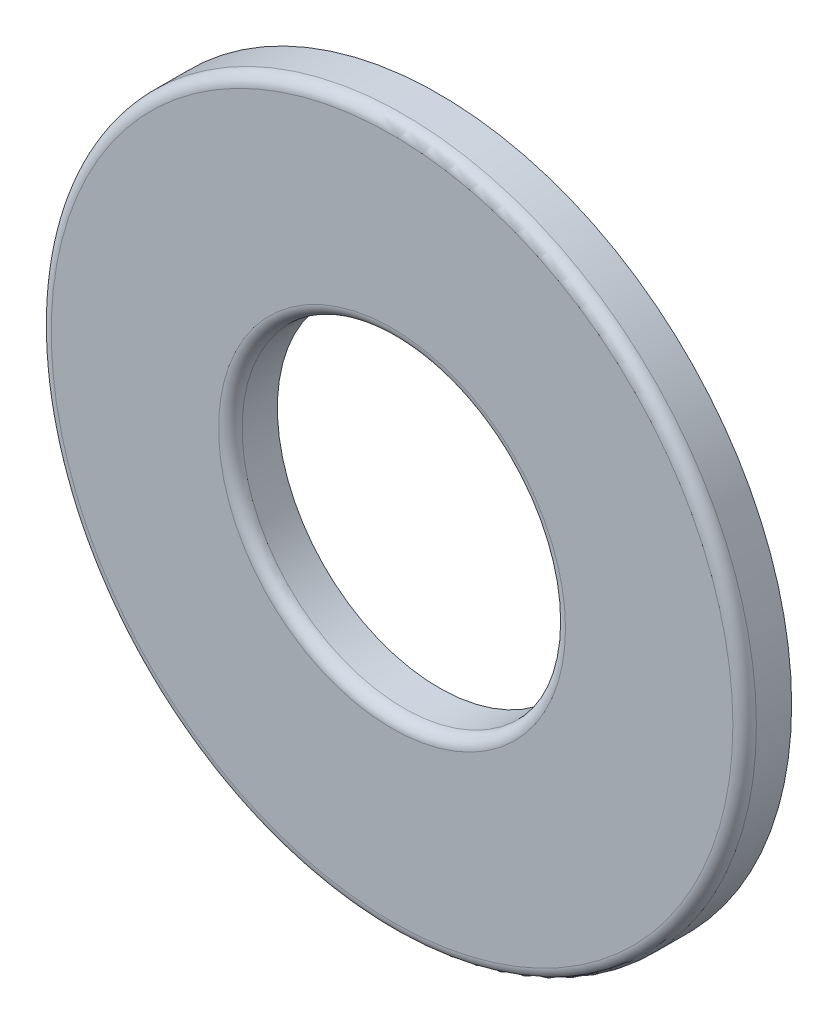
ISO-10303-21;
HEADER;
FILE_DESCRIPTION(('STEP AP214'),'2;1');
FILE_NAME('part.step','',(''),(''),'','','');
FILE_SCHEMA(('AUTOMOTIVE_DESIGN { 1 0 10303 214 1 1 1 1 }'));
ENDSEC;
DATA;
#1=APPLICATION_CONTEXT('core data for automotive mechanical design processes');
#2=APPLICATION_PROTOCOL_DEFINITION('international standard','automotive_design',2000,#1);
#3=PRODUCT_CONTEXT('',#1,'mechanical');
#4=PRODUCT('Part','Part','',(#3));
#5=PRODUCT_RELATED_PRODUCT_CATEGORY('part','',(#4));
#6=PRODUCT_DEFINITION_FORMATION('','',#4);
#7=PRODUCT_DEFINITION_CONTEXT('part definition',#1,'design');
#8=PRODUCT_DEFINITION('design','',#6,#7);
#9=PRODUCT_DEFINITION_SHAPE('','',#8);
#10=(LENGTH_UNIT() NAMED_UNIT(*) SI_UNIT(.MILLI.,.METRE.));
#11=(NAMED_UNIT(*) PLANE_ANGLE_UNIT() SI_UNIT($,.RADIAN.));
#12=(NAMED_UNIT(*) SI_UNIT($,.STERADIAN.) SOLID_ANGLE_UNIT());
#13=UNCERTAINTY_MEASURE_WITH_UNIT(LENGTH_MEASURE(1.E-05),#10,'distance_accuracy_value','');
#14=(GEOMETRIC_REPRESENTATION_CONTEXT(3) GLOBAL_UNCERTAINTY_ASSIGNED_CONTEXT((#13)) GLOBAL_UNIT_ASSIGNED_CONTEXT((#10,
#11,#12)) REPRESENTATION_CONTEXT('',''));
#15=CARTESIAN_POINT('',(0.,0.,0.));
#16=DIRECTION('',(0.,0.,1.));
#17=DIRECTION('',(1.,0.,0.));
#18=AXIS2_PLACEMENT_3D('',#15,#16,#17);
#19=CARTESIAN_POINT('',(0.,0.,0.634999999999997));
#20=DIRECTION('',(0.,0.,1.));
#21=DIRECTION('',(1.,0.,0.));
#22=AXIS2_PLACEMENT_3D('',#19,#20,#21);
#23=PLANE('',#22);
#24=CARTESIAN_POINT('',(0.,0.,0.634999999999997));
#25=DIRECTION('',(0.,0.,1.));
#26=DIRECTION('',(1.,0.,0.));
#27=AXIS2_PLACEMENT_3D('',#24,#25,#26);
#28=CIRCLE('',#27,9.2075);
#29=CARTESIAN_POINT('',(9.2075,0.,0.634999999999997));
#30=VERTEX_POINT('',#29);
#31=EDGE_CURVE('E43',#30,#30,#28,.T.);
#32=ORIENTED_EDGE('',*,*,#31,.T.);
#33=EDGE_LOOP('',(#32));
#34=FACE_BOUND('',#33,.T.);
#35=CARTESIAN_POINT('',(0.,0.,0.634999999999997));
#36=DIRECTION('',(0.,0.,1.));
#37=DIRECTION('',(1.,0.,0.));
#38=AXIS2_PLACEMENT_3D('',#35,#36,#37);
#39=CIRCLE('',#38,4.6863);
#40=CARTESIAN_POINT('',(4.6863,0.,0.634999999999997));
#41=VERTEX_POINT('',#40);
#42=EDGE_CURVE('E47',#41,#41,#39,.F.);
#43=ORIENTED_EDGE('',*,*,#42,.T.);
#44=EDGE_LOOP('',(#43));
#45=FACE_BOUND('',#44,.T.);
#46=ADVANCED_FACE('F32',(#34,#45),#23,.T.);
#47=CARTESIAN_POINT('',(0.,0.,0.634999999999997));
#48=DIRECTION('',(0.,0.,-1.));
#49=DIRECTION('',(-1.,0.,0.));
#50=AXIS2_PLACEMENT_3D('',#47,#48,#49);
#51=CYLINDRICAL_SURFACE('',#50,9.525);
#52=CARTESIAN_POINT('',(0.,0.,0.317499999999997));
#53=DIRECTION('',(0.,0.,1.));
#54=DIRECTION('',(1.,0.,0.));
#55=AXIS2_PLACEMENT_3D('',#52,#53,#54);
#56=CIRCLE('',#55,9.525);
#57=CARTESIAN_POINT('',(9.525,0.,0.317499999999997));
#58=VERTEX_POINT('',#57);
#59=EDGE_CURVE('E39',#58,#58,#56,.F.);
#60=ORIENTED_EDGE('',*,*,#59,.T.);
#61=EDGE_LOOP('',(#60));
#62=FACE_BOUND('',#61,.T.);
#63=CARTESIAN_POINT('',(0.,0.,-0.635000000000003));
#64=DIRECTION('',(0.,0.,1.));
#65=DIRECTION('',(1.,0.,0.));
#66=AXIS2_PLACEMENT_3D('',#63,#64,#65);
#67=CIRCLE('',#66,9.525);
#68=CARTESIAN_POINT('',(9.525,0.,-0.635000000000003));
#69=VERTEX_POINT('',#68);
#70=EDGE_CURVE('E52',#69,#69,#67,.T.);
#71=ORIENTED_EDGE('',*,*,#70,.T.);
#72=EDGE_LOOP('',(#71));
#73=FACE_BOUND('',#72,.T.);
#74=ADVANCED_FACE('F64',(#62,#73),#51,.T.);
#75=CARTESIAN_POINT('',(0.,0.,0.634999999999997));
#76=DIRECTION('',(0.,0.,-1.));
#77=DIRECTION('',(-1.,0.,0.));
#78=AXIS2_PLACEMENT_3D('',#75,#76,#77);
#79=CYLINDRICAL_SURFACE('',#78,4.3688);
#80=CARTESIAN_POINT('',(0.,0.,0.317499999999997));
#81=DIRECTION('',(0.,0.,1.));
#82=DIRECTION('',(1.,0.,0.));
#83=AXIS2_PLACEMENT_3D('',#80,#81,#82);
#84=CIRCLE('',#83,4.3688);
#85=CARTESIAN_POINT('',(4.3688,0.,0.317499999999997));
#86=VERTEX_POINT('',#85);
#87=EDGE_CURVE('E10',#86,#86,#84,.T.);
#88=ORIENTED_EDGE('',*,*,#87,.T.);
#89=EDGE_LOOP('',(#88));
#90=FACE_BOUND('',#89,.T.);
#91=CARTESIAN_POINT('',(0.,0.,-0.635000000000003));
#92=DIRECTION('',(0.,0.,1.));
#93=DIRECTION('',(1.,0.,0.));
#94=AXIS2_PLACEMENT_3D('',#91,#92,#93);
#95=CIRCLE('',#94,4.3688);
#96=CARTESIAN_POINT('',(4.3688,0.,-0.635000000000003));
#97=VERTEX_POINT('',#96);
#98=EDGE_CURVE('E55',#97,#97,#95,.T.);
#99=ORIENTED_EDGE('',*,*,#98,.F.);
#100=EDGE_LOOP('',(#99));
#101=FACE_BOUND('',#100,.T.);
#102=ADVANCED_FACE('F62',(#90,#101),#79,.F.);
#103=CARTESIAN_POINT('',(0.,0.,-0.635000000000003));
#104=DIRECTION('',(0.,0.,1.));
#105=DIRECTION('',(1.,0.,0.));
#106=AXIS2_PLACEMENT_3D('',#103,#104,#105);
#107=PLANE('',#106);
#108=ORIENTED_EDGE('',*,*,#98,.T.);
#109=EDGE_LOOP('',(#108));
#110=FACE_BOUND('',#109,.T.);
#111=ORIENTED_EDGE('',*,*,#70,.F.);
#112=EDGE_LOOP('',(#111));
#113=FACE_BOUND('',#112,.T.);
#114=ADVANCED_FACE('F59',(#110,#113),#107,.F.);
#115=CARTESIAN_POINT('',(0.,0.,0.317499999999997));
#116=DIRECTION('',(0.,0.,1.));
#117=DIRECTION('',(1.,0.,0.));
#118=AXIS2_PLACEMENT_3D('',#115,#116,#117);
#119=TOROIDAL_SURFACE('',#118,9.2075,0.3175);
#120=ORIENTED_EDGE('',*,*,#59,.F.);
#121=EDGE_LOOP('',(#120));
#122=FACE_BOUND('',#121,.T.);
#123=ORIENTED_EDGE('',*,*,#31,.F.);
#124=EDGE_LOOP('',(#123));
#125=FACE_BOUND('',#124,.T.);
#126=ADVANCED_FACE('F70',(#122,#125),#119,.T.);
#127=CARTESIAN_POINT('',(0.,0.,0.317499999999997));
#128=DIRECTION('',(0.,0.,1.));
#129=DIRECTION('',(1.,0.,0.));
#130=AXIS2_PLACEMENT_3D('',#127,#128,#129);
#131=TOROIDAL_SURFACE('',#130,4.6863,0.3175);
#132=ORIENTED_EDGE('',*,*,#42,.F.);
#133=EDGE_LOOP('',(#132));
#134=FACE_BOUND('',#133,.T.);
#135=ORIENTED_EDGE('',*,*,#87,.F.);
#136=EDGE_LOOP('',(#135));
#137=FACE_BOUND('',#136,.T.);
#138=ADVANCED_FACE('F34',(#134,#137),#131,.T.);
#139=CLOSED_SHELL('',(#46,#74,#102,#114,#126,#138));
#140=MANIFOLD_SOLID_BREP('B2',#139);
#141=ADVANCED_BREP_SHAPE_REPRESENTATION('',(#18,#140),#14);
#142=SHAPE_DEFINITION_REPRESENTATION(#9,#141);
ENDSEC;
END-ISO-10303-21;
